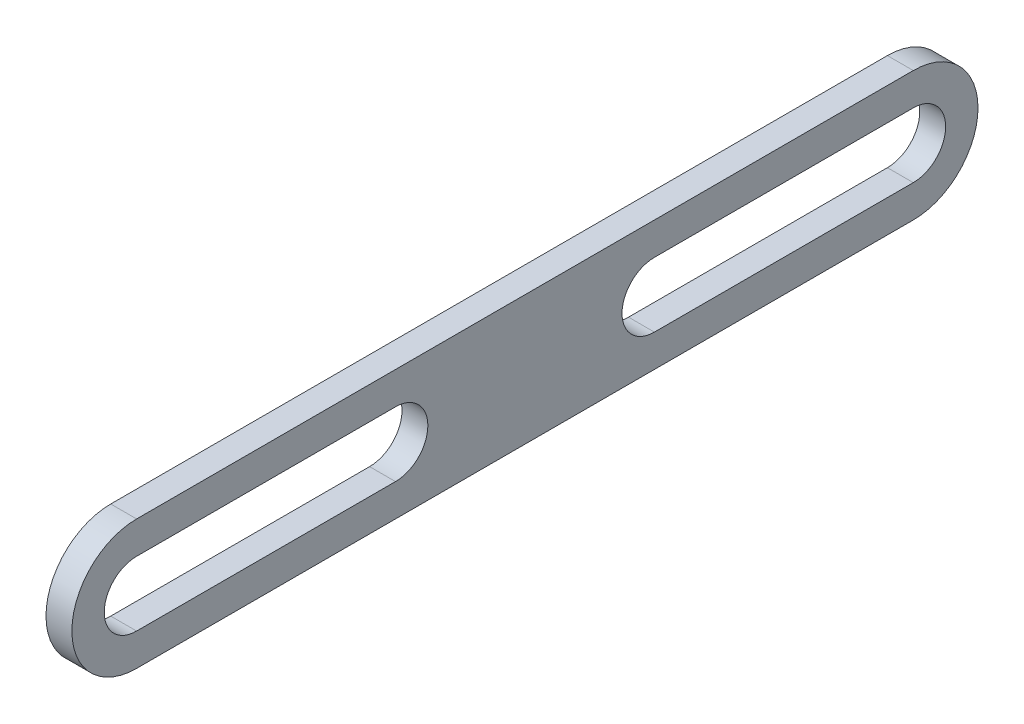
ISO-10303-21;
HEADER;
FILE_DESCRIPTION(('STEP AP214'),'2;1');
FILE_NAME('part.step','',(''),(''),'','','');
FILE_SCHEMA(('AUTOMOTIVE_DESIGN { 1 0 10303 214 1 1 1 1 }'));
ENDSEC;
DATA;
#1=APPLICATION_CONTEXT('core data for automotive mechanical design processes');
#2=APPLICATION_PROTOCOL_DEFINITION('international standard','automotive_design',2000,#1);
#3=PRODUCT_CONTEXT('',#1,'mechanical');
#4=PRODUCT('Part','Part','',(#3));
#5=PRODUCT_RELATED_PRODUCT_CATEGORY('part','',(#4));
#6=PRODUCT_DEFINITION_FORMATION('','',#4);
#7=PRODUCT_DEFINITION_CONTEXT('part definition',#1,'design');
#8=PRODUCT_DEFINITION('design','',#6,#7);
#9=PRODUCT_DEFINITION_SHAPE('','',#8);
#10=(LENGTH_UNIT() NAMED_UNIT(*) SI_UNIT(.MILLI.,.METRE.));
#11=(NAMED_UNIT(*) PLANE_ANGLE_UNIT() SI_UNIT($,.RADIAN.));
#12=(NAMED_UNIT(*) SI_UNIT($,.STERADIAN.) SOLID_ANGLE_UNIT());
#13=UNCERTAINTY_MEASURE_WITH_UNIT(LENGTH_MEASURE(1.E-05),#10,'distance_accuracy_value','');
#14=(GEOMETRIC_REPRESENTATION_CONTEXT(3) GLOBAL_UNCERTAINTY_ASSIGNED_CONTEXT((#13)) GLOBAL_UNIT_ASSIGNED_CONTEXT((#10,
#11,#12)) REPRESENTATION_CONTEXT('',''));
#15=CARTESIAN_POINT('',(0.,0.,0.));
#16=DIRECTION('',(0.,0.,1.));
#17=DIRECTION('',(1.,0.,0.));
#18=AXIS2_PLACEMENT_3D('',#15,#16,#17);
#19=CARTESIAN_POINT('',(1.27,0.,38.1));
#20=DIRECTION('',(-1.,0.,0.));
#21=DIRECTION('',(0.,0.,1.));
#22=AXIS2_PLACEMENT_3D('',#19,#20,#21);
#23=CYLINDRICAL_SURFACE('',#22,6.35000000000001);
#24=CARTESIAN_POINT('',(-1.27,0.,38.1));
#25=DIRECTION('',(1.,0.,0.));
#26=DIRECTION('',(0.,0.,-1.));
#27=AXIS2_PLACEMENT_3D('',#24,#25,#26);
#28=CIRCLE('',#27,6.35000000000001);
#29=CARTESIAN_POINT('',(-1.27,6.35000000000001,38.1));
#30=VERTEX_POINT('',#29);
#31=CARTESIAN_POINT('',(-1.27,-6.35000000000001,38.1));
#32=VERTEX_POINT('',#31);
#33=EDGE_CURVE('E178',#30,#32,#28,.T.);
#34=ORIENTED_EDGE('',*,*,#33,.T.);
#35=DIRECTION('',(-1.,0.,0.));
#36=VECTOR('',#35,1.);
#37=CARTESIAN_POINT('',(1.27,-6.35000000000001,38.1));
#38=LINE('',#37,#36);
#39=CARTESIAN_POINT('',(1.27,-6.35000000000001,38.1));
#40=VERTEX_POINT('',#39);
#41=EDGE_CURVE('E11',#40,#32,#38,.T.);
#42=ORIENTED_EDGE('',*,*,#41,.F.);
#43=CARTESIAN_POINT('',(1.27,0.,38.1));
#44=DIRECTION('',(1.,0.,0.));
#45=DIRECTION('',(0.,0.,-1.));
#46=AXIS2_PLACEMENT_3D('',#43,#44,#45);
#47=CIRCLE('',#46,6.35000000000001);
#48=CARTESIAN_POINT('',(1.27,6.35000000000001,38.1));
#49=VERTEX_POINT('',#48);
#50=EDGE_CURVE('E226',#49,#40,#47,.T.);
#51=ORIENTED_EDGE('',*,*,#50,.F.);
#52=DIRECTION('',(-1.,0.,0.));
#53=VECTOR('',#52,1.);
#54=CARTESIAN_POINT('',(1.27,6.35000000000001,38.1));
#55=LINE('',#54,#53);
#56=EDGE_CURVE('E240',#49,#30,#55,.T.);
#57=ORIENTED_EDGE('',*,*,#56,.T.);
#58=EDGE_LOOP('',(#34,#42,#51,#57));
#59=FACE_BOUND('',#58,.T.);
#60=ADVANCED_FACE('F43',(#59),#23,.T.);
#61=CARTESIAN_POINT('',(1.27,-6.35000000000001,38.1));
#62=DIRECTION('',(0.,1.,0.));
#63=DIRECTION('',(0.,0.,1.));
#64=AXIS2_PLACEMENT_3D('',#61,#62,#63);
#65=PLANE('',#64);
#66=DIRECTION('',(0.,0.,-1.));
#67=VECTOR('',#66,1.);
#68=CARTESIAN_POINT('',(-1.27,-6.35000000000001,38.1));
#69=LINE('',#68,#67);
#70=CARTESIAN_POINT('',(-1.27,-6.35,-38.1));
#71=VERTEX_POINT('',#70);
#72=EDGE_CURVE('E244',#32,#71,#69,.T.);
#73=ORIENTED_EDGE('',*,*,#72,.T.);
#74=DIRECTION('',(-1.,0.,0.));
#75=VECTOR('',#74,1.);
#76=CARTESIAN_POINT('',(1.27,-6.35,-38.1));
#77=LINE('',#76,#75);
#78=CARTESIAN_POINT('',(1.27,-6.35,-38.1));
#79=VERTEX_POINT('',#78);
#80=EDGE_CURVE('E51',#79,#71,#77,.T.);
#81=ORIENTED_EDGE('',*,*,#80,.F.);
#82=DIRECTION('',(0.,0.,-1.));
#83=VECTOR('',#82,1.);
#84=CARTESIAN_POINT('',(1.27,-6.35000000000001,38.1));
#85=LINE('',#84,#83);
#86=EDGE_CURVE('E230',#40,#79,#85,.T.);
#87=ORIENTED_EDGE('',*,*,#86,.F.);
#88=ORIENTED_EDGE('',*,*,#41,.T.);
#89=EDGE_LOOP('',(#73,#81,#87,#88));
#90=FACE_BOUND('',#89,.T.);
#91=ADVANCED_FACE('F279',(#90),#65,.F.);
#92=CARTESIAN_POINT('',(1.27,0.,-38.1));
#93=DIRECTION('',(-1.,0.,0.));
#94=DIRECTION('',(0.,0.,1.));
#95=AXIS2_PLACEMENT_3D('',#92,#93,#94);
#96=CYLINDRICAL_SURFACE('',#95,6.35000000000001);
#97=CARTESIAN_POINT('',(-1.27,0.,-38.1));
#98=DIRECTION('',(1.,0.,0.));
#99=DIRECTION('',(0.,0.,-1.));
#100=AXIS2_PLACEMENT_3D('',#97,#98,#99);
#101=CIRCLE('',#100,6.35000000000001);
#102=CARTESIAN_POINT('',(-1.27,6.35000000000003,-38.1));
#103=VERTEX_POINT('',#102);
#104=EDGE_CURVE('E247',#71,#103,#101,.T.);
#105=ORIENTED_EDGE('',*,*,#104,.T.);
#106=DIRECTION('',(-1.,0.,0.));
#107=VECTOR('',#106,1.);
#108=CARTESIAN_POINT('',(1.27,6.35000000000003,-38.1));
#109=LINE('',#108,#107);
#110=CARTESIAN_POINT('',(1.27,6.35000000000003,-38.1));
#111=VERTEX_POINT('',#110);
#112=EDGE_CURVE('E255',#111,#103,#109,.T.);
#113=ORIENTED_EDGE('',*,*,#112,.F.);
#114=CARTESIAN_POINT('',(1.27,0.,-38.1));
#115=DIRECTION('',(1.,0.,0.));
#116=DIRECTION('',(0.,0.,-1.));
#117=AXIS2_PLACEMENT_3D('',#114,#115,#116);
#118=CIRCLE('',#117,6.35000000000001);
#119=EDGE_CURVE('E234',#79,#111,#118,.T.);
#120=ORIENTED_EDGE('',*,*,#119,.F.);
#121=ORIENTED_EDGE('',*,*,#80,.T.);
#122=EDGE_LOOP('',(#105,#113,#120,#121));
#123=FACE_BOUND('',#122,.T.);
#124=ADVANCED_FACE('F264',(#123),#96,.T.);
#125=CARTESIAN_POINT('',(1.27,6.35000000000001,38.1));
#126=DIRECTION('',(0.,-1.,0.));
#127=DIRECTION('',(0.,0.,-1.));
#128=AXIS2_PLACEMENT_3D('',#125,#126,#127);
#129=PLANE('',#128);
#130=DIRECTION('',(0.,0.,1.));
#131=VECTOR('',#130,1.);
#132=CARTESIAN_POINT('',(-1.27,6.35000000000001,38.1));
#133=LINE('',#132,#131);
#134=EDGE_CURVE('E231',#103,#30,#133,.T.);
#135=ORIENTED_EDGE('',*,*,#134,.T.);
#136=ORIENTED_EDGE('',*,*,#56,.F.);
#137=DIRECTION('',(0.,0.,1.));
#138=VECTOR('',#137,1.);
#139=CARTESIAN_POINT('',(1.27,6.35000000000001,38.1));
#140=LINE('',#139,#138);
#141=EDGE_CURVE('E237',#111,#49,#140,.T.);
#142=ORIENTED_EDGE('',*,*,#141,.F.);
#143=ORIENTED_EDGE('',*,*,#112,.T.);
#144=EDGE_LOOP('',(#135,#136,#142,#143));
#145=FACE_BOUND('',#144,.T.);
#146=ADVANCED_FACE('F272',(#145),#129,.F.);
#147=CARTESIAN_POINT('',(1.27,0.,38.1));
#148=DIRECTION('',(1.,0.,0.));
#149=DIRECTION('',(0.,0.,-1.));
#150=AXIS2_PLACEMENT_3D('',#147,#148,#149);
#151=PLANE('',#150);
#152=CARTESIAN_POINT('',(1.27,0.,38.1));
#153=DIRECTION('',(1.,0.,0.));
#154=DIRECTION('',(0.,0.,-1.));
#155=AXIS2_PLACEMENT_3D('',#152,#153,#154);
#156=CIRCLE('',#155,3.175);
#157=CARTESIAN_POINT('',(1.27,3.175,38.1));
#158=VERTEX_POINT('',#157);
#159=CARTESIAN_POINT('',(1.27,-3.175,38.1));
#160=VERTEX_POINT('',#159);
#161=EDGE_CURVE('E58',#158,#160,#156,.T.);
#162=ORIENTED_EDGE('',*,*,#161,.F.);
#163=DIRECTION('',(0.,0.,1.));
#164=VECTOR('',#163,1.);
#165=CARTESIAN_POINT('',(1.27,3.175,38.1));
#166=LINE('',#165,#164);
#167=CARTESIAN_POINT('',(1.27,3.175,12.7));
#168=VERTEX_POINT('',#167);
#169=EDGE_CURVE('E156',#168,#158,#166,.T.);
#170=ORIENTED_EDGE('',*,*,#169,.F.);
#171=CARTESIAN_POINT('',(1.27,0.,12.7));
#172=DIRECTION('',(1.,0.,0.));
#173=DIRECTION('',(0.,0.,-1.));
#174=AXIS2_PLACEMENT_3D('',#171,#172,#173);
#175=CIRCLE('',#174,3.175);
#176=CARTESIAN_POINT('',(1.27,-3.175,12.7));
#177=VERTEX_POINT('',#176);
#178=EDGE_CURVE('E160',#177,#168,#175,.T.);
#179=ORIENTED_EDGE('',*,*,#178,.F.);
#180=DIRECTION('',(0.,0.,-1.));
#181=VECTOR('',#180,1.);
#182=CARTESIAN_POINT('',(1.27,-3.175,38.1));
#183=LINE('',#182,#181);
#184=EDGE_CURVE('E169',#160,#177,#183,.T.);
#185=ORIENTED_EDGE('',*,*,#184,.F.);
#186=EDGE_LOOP('',(#162,#170,#179,#185));
#187=FACE_BOUND('',#186,.T.);
#188=CARTESIAN_POINT('',(1.27,0.,-38.1));
#189=DIRECTION('',(1.,0.,0.));
#190=DIRECTION('',(0.,0.,1.));
#191=AXIS2_PLACEMENT_3D('',#188,#189,#190);
#192=CIRCLE('',#191,3.175);
#193=CARTESIAN_POINT('',(1.27,-3.175,-38.1));
#194=VERTEX_POINT('',#193);
#195=CARTESIAN_POINT('',(1.27,3.175,-38.1));
#196=VERTEX_POINT('',#195);
#197=EDGE_CURVE('E66',#194,#196,#192,.T.);
#198=ORIENTED_EDGE('',*,*,#197,.F.);
#199=DIRECTION('',(0.,0.,-1.));
#200=VECTOR('',#199,1.);
#201=CARTESIAN_POINT('',(1.27,-3.175,-38.1));
#202=LINE('',#201,#200);
#203=CARTESIAN_POINT('',(1.27,-3.175,-12.7));
#204=VERTEX_POINT('',#203);
#205=EDGE_CURVE('E197',#204,#194,#202,.T.);
#206=ORIENTED_EDGE('',*,*,#205,.F.);
#207=CARTESIAN_POINT('',(1.27,0.,-12.7));
#208=DIRECTION('',(1.,0.,0.));
#209=DIRECTION('',(0.,0.,1.));
#210=AXIS2_PLACEMENT_3D('',#207,#208,#209);
#211=CIRCLE('',#210,3.175);
#212=CARTESIAN_POINT('',(1.27,3.175,-12.7));
#213=VERTEX_POINT('',#212);
#214=EDGE_CURVE('E201',#213,#204,#211,.T.);
#215=ORIENTED_EDGE('',*,*,#214,.F.);
#216=DIRECTION('',(0.,0.,1.));
#217=VECTOR('',#216,1.);
#218=CARTESIAN_POINT('',(1.27,3.175,-38.1));
#219=LINE('',#218,#217);
#220=EDGE_CURVE('E206',#196,#213,#219,.T.);
#221=ORIENTED_EDGE('',*,*,#220,.F.);
#222=EDGE_LOOP('',(#198,#206,#215,#221));
#223=FACE_BOUND('',#222,.T.);
#224=ORIENTED_EDGE('',*,*,#50,.T.);
#225=ORIENTED_EDGE('',*,*,#86,.T.);
#226=ORIENTED_EDGE('',*,*,#119,.T.);
#227=ORIENTED_EDGE('',*,*,#141,.T.);
#228=EDGE_LOOP('',(#224,#225,#226,#227));
#229=FACE_BOUND('',#228,.T.);
#230=ADVANCED_FACE('F278',(#187,#223,#229),#151,.T.);
#231=CARTESIAN_POINT('',(-1.27,0.,38.1));
#232=DIRECTION('',(1.,0.,0.));
#233=DIRECTION('',(0.,0.,-1.));
#234=AXIS2_PLACEMENT_3D('',#231,#232,#233);
#235=PLANE('',#234);
#236=DIRECTION('',(0.,0.,1.));
#237=VECTOR('',#236,1.);
#238=CARTESIAN_POINT('',(-1.27,3.175,38.1));
#239=LINE('',#238,#237);
#240=CARTESIAN_POINT('',(-1.27,3.175,12.7));
#241=VERTEX_POINT('',#240);
#242=CARTESIAN_POINT('',(-1.27,3.175,38.1));
#243=VERTEX_POINT('',#242);
#244=EDGE_CURVE('E141',#241,#243,#239,.T.);
#245=ORIENTED_EDGE('',*,*,#244,.T.);
#246=CARTESIAN_POINT('',(-1.27,0.,38.1));
#247=DIRECTION('',(1.,0.,0.));
#248=DIRECTION('',(0.,0.,-1.));
#249=AXIS2_PLACEMENT_3D('',#246,#247,#248);
#250=CIRCLE('',#249,3.175);
#251=CARTESIAN_POINT('',(-1.27,-3.175,38.1));
#252=VERTEX_POINT('',#251);
#253=EDGE_CURVE('E134',#243,#252,#250,.T.);
#254=ORIENTED_EDGE('',*,*,#253,.T.);
#255=DIRECTION('',(0.,0.,-1.));
#256=VECTOR('',#255,1.);
#257=CARTESIAN_POINT('',(-1.27,-3.175,38.1));
#258=LINE('',#257,#256);
#259=CARTESIAN_POINT('',(-1.27,-3.175,12.7));
#260=VERTEX_POINT('',#259);
#261=EDGE_CURVE('E145',#252,#260,#258,.T.);
#262=ORIENTED_EDGE('',*,*,#261,.T.);
#263=CARTESIAN_POINT('',(-1.27,0.,12.7));
#264=DIRECTION('',(1.,0.,0.));
#265=DIRECTION('',(0.,0.,-1.));
#266=AXIS2_PLACEMENT_3D('',#263,#264,#265);
#267=CIRCLE('',#266,3.175);
#268=EDGE_CURVE('E150',#260,#241,#267,.T.);
#269=ORIENTED_EDGE('',*,*,#268,.T.);
#270=EDGE_LOOP('',(#245,#254,#262,#269));
#271=FACE_BOUND('',#270,.T.);
#272=DIRECTION('',(0.,0.,-1.));
#273=VECTOR('',#272,1.);
#274=CARTESIAN_POINT('',(-1.27,-3.175,-38.1));
#275=LINE('',#274,#273);
#276=CARTESIAN_POINT('',(-1.27,-3.175,-12.7));
#277=VERTEX_POINT('',#276);
#278=CARTESIAN_POINT('',(-1.27,-3.175,-38.1));
#279=VERTEX_POINT('',#278);
#280=EDGE_CURVE('E187',#277,#279,#275,.T.);
#281=ORIENTED_EDGE('',*,*,#280,.T.);
#282=CARTESIAN_POINT('',(-1.27,0.,-38.1));
#283=DIRECTION('',(1.,0.,0.));
#284=DIRECTION('',(0.,0.,1.));
#285=AXIS2_PLACEMENT_3D('',#282,#283,#284);
#286=CIRCLE('',#285,3.175);
#287=CARTESIAN_POINT('',(-1.27,3.175,-38.1));
#288=VERTEX_POINT('',#287);
#289=EDGE_CURVE('E202',#279,#288,#286,.T.);
#290=ORIENTED_EDGE('',*,*,#289,.T.);
#291=DIRECTION('',(0.,0.,1.));
#292=VECTOR('',#291,1.);
#293=CARTESIAN_POINT('',(-1.27,3.175,-38.1));
#294=LINE('',#293,#292);
#295=CARTESIAN_POINT('',(-1.27,3.175,-12.7));
#296=VERTEX_POINT('',#295);
#297=EDGE_CURVE('E219',#288,#296,#294,.T.);
#298=ORIENTED_EDGE('',*,*,#297,.T.);
#299=CARTESIAN_POINT('',(-1.27,0.,-12.7));
#300=DIRECTION('',(1.,0.,0.));
#301=DIRECTION('',(0.,0.,1.));
#302=AXIS2_PLACEMENT_3D('',#299,#300,#301);
#303=CIRCLE('',#302,3.175);
#304=EDGE_CURVE('E215',#296,#277,#303,.T.);
#305=ORIENTED_EDGE('',*,*,#304,.T.);
#306=EDGE_LOOP('',(#281,#290,#298,#305));
#307=FACE_BOUND('',#306,.T.);
#308=ORIENTED_EDGE('',*,*,#33,.F.);
#309=ORIENTED_EDGE('',*,*,#134,.F.);
#310=ORIENTED_EDGE('',*,*,#104,.F.);
#311=ORIENTED_EDGE('',*,*,#72,.F.);
#312=EDGE_LOOP('',(#308,#309,#310,#311));
#313=FACE_BOUND('',#312,.T.);
#314=ADVANCED_FACE('F152',(#271,#307,#313),#235,.F.);
#315=CARTESIAN_POINT('',(-1.27,0.,-38.1));
#316=DIRECTION('',(1.,0.,0.));
#317=DIRECTION('',(0.,0.,-1.));
#318=AXIS2_PLACEMENT_3D('',#315,#316,#317);
#319=CYLINDRICAL_SURFACE('',#318,3.175);
#320=ORIENTED_EDGE('',*,*,#197,.T.);
#321=DIRECTION('',(1.,0.,0.));
#322=VECTOR('',#321,1.);
#323=CARTESIAN_POINT('',(-1.27,3.175,-38.1));
#324=LINE('',#323,#322);
#325=EDGE_CURVE('E184',#288,#196,#324,.T.);
#326=ORIENTED_EDGE('',*,*,#325,.F.);
#327=ORIENTED_EDGE('',*,*,#289,.F.);
#328=DIRECTION('',(1.,0.,0.));
#329=VECTOR('',#328,1.);
#330=CARTESIAN_POINT('',(-1.27,-3.175,-38.1));
#331=LINE('',#330,#329);
#332=EDGE_CURVE('E194',#279,#194,#331,.T.);
#333=ORIENTED_EDGE('',*,*,#332,.T.);
#334=EDGE_LOOP('',(#320,#326,#327,#333));
#335=FACE_BOUND('',#334,.T.);
#336=ADVANCED_FACE('F291',(#335),#319,.F.);
#337=CARTESIAN_POINT('',(-1.27,-3.175,-38.1));
#338=DIRECTION('',(0.,-1.,0.));
#339=DIRECTION('',(0.,0.,-1.));
#340=AXIS2_PLACEMENT_3D('',#337,#338,#339);
#341=PLANE('',#340);
#342=ORIENTED_EDGE('',*,*,#205,.T.);
#343=ORIENTED_EDGE('',*,*,#332,.F.);
#344=ORIENTED_EDGE('',*,*,#280,.F.);
#345=DIRECTION('',(1.,0.,0.));
#346=VECTOR('',#345,1.);
#347=CARTESIAN_POINT('',(-1.27,-3.175,-12.7));
#348=LINE('',#347,#346);
#349=EDGE_CURVE('E191',#277,#204,#348,.T.);
#350=ORIENTED_EDGE('',*,*,#349,.T.);
#351=EDGE_LOOP('',(#342,#343,#344,#350));
#352=FACE_BOUND('',#351,.T.);
#353=ADVANCED_FACE('F295',(#352),#341,.F.);
#354=CARTESIAN_POINT('',(-1.27,0.,-12.7));
#355=DIRECTION('',(1.,0.,0.));
#356=DIRECTION('',(0.,0.,-1.));
#357=AXIS2_PLACEMENT_3D('',#354,#355,#356);
#358=CYLINDRICAL_SURFACE('',#357,3.175);
#359=ORIENTED_EDGE('',*,*,#214,.T.);
#360=ORIENTED_EDGE('',*,*,#349,.F.);
#361=ORIENTED_EDGE('',*,*,#304,.F.);
#362=DIRECTION('',(1.,0.,0.));
#363=VECTOR('',#362,1.);
#364=CARTESIAN_POINT('',(-1.27,3.175,-12.7));
#365=LINE('',#364,#363);
#366=EDGE_CURVE('E188',#296,#213,#365,.T.);
#367=ORIENTED_EDGE('',*,*,#366,.T.);
#368=EDGE_LOOP('',(#359,#360,#361,#367));
#369=FACE_BOUND('',#368,.T.);
#370=ADVANCED_FACE('F298',(#369),#358,.F.);
#371=CARTESIAN_POINT('',(-1.27,3.175,-38.1));
#372=DIRECTION('',(0.,1.,0.));
#373=DIRECTION('',(0.,0.,1.));
#374=AXIS2_PLACEMENT_3D('',#371,#372,#373);
#375=PLANE('',#374);
#376=ORIENTED_EDGE('',*,*,#220,.T.);
#377=ORIENTED_EDGE('',*,*,#366,.F.);
#378=ORIENTED_EDGE('',*,*,#297,.F.);
#379=ORIENTED_EDGE('',*,*,#325,.T.);
#380=EDGE_LOOP('',(#376,#377,#378,#379));
#381=FACE_BOUND('',#380,.T.);
#382=ADVANCED_FACE('F302',(#381),#375,.F.);
#383=CARTESIAN_POINT('',(-1.27,0.,38.1));
#384=DIRECTION('',(1.,0.,0.));
#385=DIRECTION('',(0.,0.,-1.));
#386=AXIS2_PLACEMENT_3D('',#383,#384,#385);
#387=CYLINDRICAL_SURFACE('',#386,3.175);
#388=ORIENTED_EDGE('',*,*,#161,.T.);
#389=DIRECTION('',(1.,0.,0.));
#390=VECTOR('',#389,1.);
#391=CARTESIAN_POINT('',(-1.27,-3.175,38.1));
#392=LINE('',#391,#390);
#393=EDGE_CURVE('E130',#252,#160,#392,.T.);
#394=ORIENTED_EDGE('',*,*,#393,.F.);
#395=ORIENTED_EDGE('',*,*,#253,.F.);
#396=DIRECTION('',(1.,0.,0.));
#397=VECTOR('',#396,1.);
#398=CARTESIAN_POINT('',(-1.27,3.175,38.1));
#399=LINE('',#398,#397);
#400=EDGE_CURVE('E175',#243,#158,#399,.T.);
#401=ORIENTED_EDGE('',*,*,#400,.T.);
#402=EDGE_LOOP('',(#388,#394,#395,#401));
#403=FACE_BOUND('',#402,.T.);
#404=ADVANCED_FACE('F132',(#403),#387,.F.);
#405=CARTESIAN_POINT('',(-1.27,3.175,38.1));
#406=DIRECTION('',(0.,1.,0.));
#407=DIRECTION('',(0.,0.,1.));
#408=AXIS2_PLACEMENT_3D('',#405,#406,#407);
#409=PLANE('',#408);
#410=ORIENTED_EDGE('',*,*,#169,.T.);
#411=ORIENTED_EDGE('',*,*,#400,.F.);
#412=ORIENTED_EDGE('',*,*,#244,.F.);
#413=DIRECTION('',(1.,0.,0.));
#414=VECTOR('',#413,1.);
#415=CARTESIAN_POINT('',(-1.27,3.175,12.7));
#416=LINE('',#415,#414);
#417=EDGE_CURVE('E179',#241,#168,#416,.T.);
#418=ORIENTED_EDGE('',*,*,#417,.T.);
#419=EDGE_LOOP('',(#410,#411,#412,#418));
#420=FACE_BOUND('',#419,.T.);
#421=ADVANCED_FACE('F311',(#420),#409,.F.);
#422=CARTESIAN_POINT('',(-1.27,0.,12.7));
#423=DIRECTION('',(1.,0.,0.));
#424=DIRECTION('',(0.,0.,-1.));
#425=AXIS2_PLACEMENT_3D('',#422,#423,#424);
#426=CYLINDRICAL_SURFACE('',#425,3.175);
#427=ORIENTED_EDGE('',*,*,#178,.T.);
#428=ORIENTED_EDGE('',*,*,#417,.F.);
#429=ORIENTED_EDGE('',*,*,#268,.F.);
#430=DIRECTION('',(1.,0.,0.));
#431=VECTOR('',#430,1.);
#432=CARTESIAN_POINT('',(-1.27,-3.175,12.7));
#433=LINE('',#432,#431);
#434=EDGE_CURVE('E140',#260,#177,#433,.T.);
#435=ORIENTED_EDGE('',*,*,#434,.T.);
#436=EDGE_LOOP('',(#427,#428,#429,#435));
#437=FACE_BOUND('',#436,.T.);
#438=ADVANCED_FACE('F314',(#437),#426,.F.);
#439=CARTESIAN_POINT('',(-1.27,-3.175,38.1));
#440=DIRECTION('',(0.,-1.,0.));
#441=DIRECTION('',(0.,0.,-1.));
#442=AXIS2_PLACEMENT_3D('',#439,#440,#441);
#443=PLANE('',#442);
#444=ORIENTED_EDGE('',*,*,#184,.T.);
#445=ORIENTED_EDGE('',*,*,#434,.F.);
#446=ORIENTED_EDGE('',*,*,#261,.F.);
#447=ORIENTED_EDGE('',*,*,#393,.T.);
#448=EDGE_LOOP('',(#444,#445,#446,#447));
#449=FACE_BOUND('',#448,.T.);
#450=ADVANCED_FACE('F146',(#449),#443,.F.);
#451=CLOSED_SHELL('',(#60,#91,#124,#146,#230,#314,#336,#353,#370,#382,#404,#421,#438,#450));
#452=MANIFOLD_SOLID_BREP('B2',#451);
#453=ADVANCED_BREP_SHAPE_REPRESENTATION('',(#18,#452),#14);
#454=SHAPE_DEFINITION_REPRESENTATION(#9,#453);
ENDSEC;
END-ISO-10303-21;
